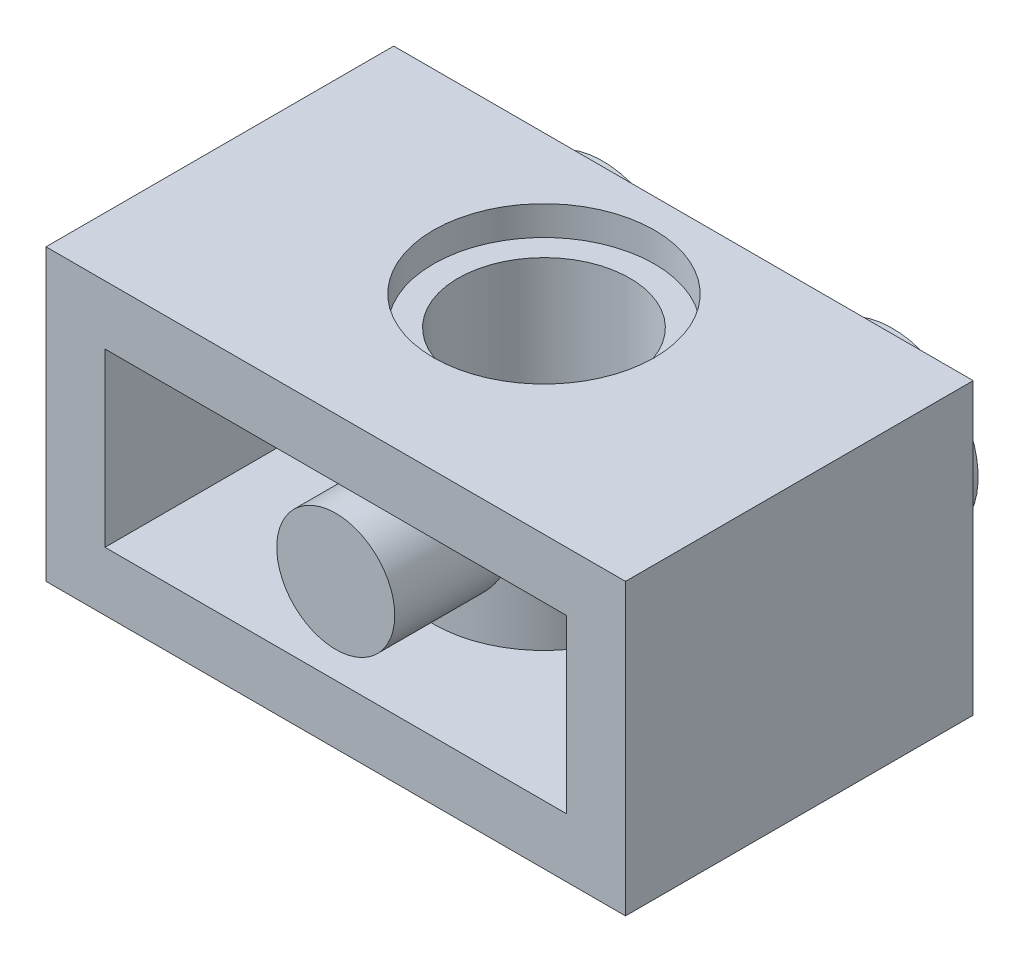
ISO-10303-21;
HEADER;
FILE_DESCRIPTION(('STEP AP214'),'2;1');
FILE_NAME('part.step','',(''),(''),'','','');
FILE_SCHEMA(('AUTOMOTIVE_DESIGN { 1 0 10303 214 1 1 1 1 }'));
ENDSEC;
DATA;
#1=APPLICATION_CONTEXT('core data for automotive mechanical design processes');
#2=APPLICATION_PROTOCOL_DEFINITION('international standard','automotive_design',2000,#1);
#3=PRODUCT_CONTEXT('',#1,'mechanical');
#4=PRODUCT('Part','Part','',(#3));
#5=PRODUCT_RELATED_PRODUCT_CATEGORY('part','',(#4));
#6=PRODUCT_DEFINITION_FORMATION('','',#4);
#7=PRODUCT_DEFINITION_CONTEXT('part definition',#1,'design');
#8=PRODUCT_DEFINITION('design','',#6,#7);
#9=PRODUCT_DEFINITION_SHAPE('','',#8);
#10=(LENGTH_UNIT() NAMED_UNIT(*) SI_UNIT(.MILLI.,.METRE.));
#11=(NAMED_UNIT(*) PLANE_ANGLE_UNIT() SI_UNIT($,.RADIAN.));
#12=(NAMED_UNIT(*) SI_UNIT($,.STERADIAN.) SOLID_ANGLE_UNIT());
#13=UNCERTAINTY_MEASURE_WITH_UNIT(LENGTH_MEASURE(1.E-05),#10,'distance_accuracy_value','');
#14=(GEOMETRIC_REPRESENTATION_CONTEXT(3) GLOBAL_UNCERTAINTY_ASSIGNED_CONTEXT((#13)) GLOBAL_UNIT_ASSIGNED_CONTEXT((#10,
#11,#12)) REPRESENTATION_CONTEXT('',''));
#15=CARTESIAN_POINT('',(0.,0.,0.));
#16=DIRECTION('',(0.,0.,1.));
#17=DIRECTION('',(1.,0.,0.));
#18=AXIS2_PLACEMENT_3D('',#15,#16,#17);
#19=CARTESIAN_POINT('',(0.,-4.0325,4.839));
#20=DIRECTION('',(0.,0.,1.));
#21=DIRECTION('',(1.,0.,0.));
#22=AXIS2_PLACEMENT_3D('',#19,#20,#21);
#23=PLANE('',#22);
#24=CARTESIAN_POINT('',(0.,0.,4.839));
#25=DIRECTION('',(0.,0.,1.));
#26=DIRECTION('',(1.,0.,0.));
#27=AXIS2_PLACEMENT_3D('',#24,#25,#26);
#28=CIRCLE('',#27,1.6425);
#29=CARTESIAN_POINT('',(1.6425,0.,4.839));
#30=VERTEX_POINT('',#29);
#31=EDGE_CURVE('E19',#30,#30,#28,.F.);
#32=ORIENTED_EDGE('',*,*,#31,.F.);
#33=EDGE_LOOP('',(#32));
#34=FACE_BOUND('',#33,.T.);
#35=ADVANCED_FACE('F16',(#34),#23,.T.);
#36=CARTESIAN_POINT('',(8.065,-4.0325,-4.839));
#37=DIRECTION('',(0.,0.,-1.));
#38=DIRECTION('',(-1.,0.,0.));
#39=AXIS2_PLACEMENT_3D('',#36,#37,#38);
#40=PLANE('',#39);
#41=CARTESIAN_POINT('',(-4.0325,0.,-4.839));
#42=DIRECTION('',(0.,0.,-1.));
#43=DIRECTION('',(-1.,0.,0.));
#44=AXIS2_PLACEMENT_3D('',#41,#42,#43);
#45=CIRCLE('',#44,1.6425);
#46=CARTESIAN_POINT('',(-5.675,0.,-4.839));
#47=VERTEX_POINT('',#46);
#48=EDGE_CURVE('E368',#47,#47,#45,.T.);
#49=ORIENTED_EDGE('',*,*,#48,.T.);
#50=EDGE_LOOP('',(#49));
#51=FACE_BOUND('',#50,.T.);
#52=ADVANCED_FACE('F379',(#51),#40,.T.);
#53=CARTESIAN_POINT('',(8.065,-4.0325,-4.839));
#54=DIRECTION('',(0.,0.,-1.));
#55=DIRECTION('',(-1.,0.,0.));
#56=AXIS2_PLACEMENT_3D('',#53,#54,#55);
#57=PLANE('',#56);
#58=CARTESIAN_POINT('',(4.0325,0.,-4.839));
#59=DIRECTION('',(0.,0.,-1.));
#60=DIRECTION('',(-1.,0.,0.));
#61=AXIS2_PLACEMENT_3D('',#58,#59,#60);
#62=CIRCLE('',#61,1.6425);
#63=CARTESIAN_POINT('',(2.39,0.,-4.839));
#64=VERTEX_POINT('',#63);
#65=EDGE_CURVE('E142',#64,#64,#62,.T.);
#66=ORIENTED_EDGE('',*,*,#65,.T.);
#67=EDGE_LOOP('',(#66));
#68=FACE_BOUND('',#67,.T.);
#69=ADVANCED_FACE('F174',(#68),#57,.T.);
#70=CARTESIAN_POINT('',(0.,0.,4.839));
#71=DIRECTION('',(0.,0.,1.));
#72=DIRECTION('',(1.,0.,0.));
#73=AXIS2_PLACEMENT_3D('',#70,#71,#72);
#74=CYLINDRICAL_SURFACE('',#73,1.6425);
#75=ORIENTED_EDGE('',*,*,#31,.T.);
#76=EDGE_LOOP('',(#75));
#77=FACE_BOUND('',#76,.T.);
#78=CARTESIAN_POINT('',(-1.64249999485551,-3.70608180880229E-08,1.64358049216812));
#79=CARTESIAN_POINT('',(-1.64249559488355,0.0846956475252511,1.64358653790426));
#80=CARTESIAN_POINT('',(-1.6359087181486,0.169429857933965,1.64778101822955));
#81=CARTESIAN_POINT('',(-1.60994606027142,0.336190357602549,1.66390797739999));
#82=CARTESIAN_POINT('',(-1.59055517110292,0.418213327546044,1.67584959714927));
#83=CARTESIAN_POINT('',(-1.54010835824431,0.576860048086994,1.7056790936548));
#84=CARTESIAN_POINT('',(-1.50911852183764,0.653511520501801,1.72353321757458));
#85=CARTESIAN_POINT('',(-1.43656232796772,0.800513698090321,1.76312072073227));
#86=CARTESIAN_POINT('',(-1.39499295203209,0.870862597304915,1.78485520655587));
#87=CARTESIAN_POINT('',(-1.29784534916877,1.01060123957711,1.83226270823662));
#88=CARTESIAN_POINT('',(-1.24131233018339,1.07926703560096,1.85811375790081));
#89=CARTESIAN_POINT('',(-1.1178193417297,1.20671694485721,1.90941067305075));
#90=CARTESIAN_POINT('',(-1.05085372779594,1.26549567276215,1.93485631092861));
#91=CARTESIAN_POINT('',(-0.901893193080416,1.37610494028443,1.98489421523878));
#92=CARTESIAN_POINT('',(-0.819126036246932,1.42700919532592,2.00925709184428));
#93=CARTESIAN_POINT('',(-0.644655617859076,1.51383563168207,2.05200360082336));
#94=CARTESIAN_POINT('',(-0.552958843313448,1.54976859034089,2.07039153225742));
#95=CARTESIAN_POINT('',(-0.370934827626963,1.60264427144133,2.09782047739748));
#96=CARTESIAN_POINT('',(-0.281076067235135,1.62086740993668,2.10748728919025));
#97=CARTESIAN_POINT('',(-0.0991002933566199,1.64205933699828,2.1187507287066));
#98=CARTESIAN_POINT('',(-0.00698491182808272,1.64503884034871,2.12035302498276));
#99=CARTESIAN_POINT('',(0.167108617996855,1.63606845448583,2.11556844546189));
#100=CARTESIAN_POINT('',(0.249188218699515,1.62556615202254,2.10995614033198));
#101=CARTESIAN_POINT('',(0.410213154137852,1.59257225857043,2.09259125338547));
#102=CARTESIAN_POINT('',(0.489158265170417,1.57007981351251,2.08083823416124));
#103=CARTESIAN_POINT('',(0.642909969351374,1.51369183544886,2.05207057777214));
#104=CARTESIAN_POINT('',(0.717655865444991,1.47966330485719,2.03499476891686));
#105=CARTESIAN_POINT('',(0.860534710738926,1.40140238504881,1.9970623061314));
#106=CARTESIAN_POINT('',(0.928665497240362,1.35716667461911,1.97620442206344));
#107=CARTESIAN_POINT('',(1.06393306770279,1.25450831465863,1.93005135316963));
#108=CARTESIAN_POINT('',(1.13023403989571,1.19509015135897,1.90452031891285));
#109=CARTESIAN_POINT('',(1.25242227087692,1.06636378833612,1.85317534520696));
#110=CARTESIAN_POINT('',(1.30829806027793,0.997044842399312,1.82736112687123));
#111=CARTESIAN_POINT('',(1.41247891680776,0.843783437917859,1.77606201444236));
#112=CARTESIAN_POINT('',(1.4598184152903,0.759114247875707,1.75076930029746));
#113=CARTESIAN_POINT('',(1.53919934555228,0.581451919872124,1.70643849654131));
#114=CARTESIAN_POINT('',(1.57127381353549,0.488477279464372,1.68738692812425));
#115=CARTESIAN_POINT('',(1.61056026257685,0.328976224491044,1.66355174845996));
#116=CARTESIAN_POINT('',(1.62249761589875,0.263981779092716,1.65612822510832));
#117=CARTESIAN_POINT('',(1.63846783889228,0.132665803586769,1.64614107191913));
#118=CARTESIAN_POINT('',(1.64250344608909,0.0663447411269074,1.64357575898606));
#119=CARTESIAN_POINT('',(1.6424956007207,-0.0846956456049919,1.6435865410049));
#120=CARTESIAN_POINT('',(1.63590871989194,-0.16942985601023,1.64778101894795));
#121=CARTESIAN_POINT('',(1.60994605907705,-0.336190355990545,1.66390797633834));
#122=CARTESIAN_POINT('',(1.59055517104549,-0.418213326243841,1.67584959670871));
#123=CARTESIAN_POINT('',(1.540108359019,-0.576860047125375,1.70567909366854));
#124=CARTESIAN_POINT('',(1.50911852234774,-0.653511519584645,1.72353321740947));
#125=CARTESIAN_POINT('',(1.43656232836588,-0.800513697167399,1.76312072040175));
#126=CARTESIAN_POINT('',(1.39499295259801,-0.870862596340753,1.78485520623334));
#127=CARTESIAN_POINT('',(1.29784534998339,-1.0106012385697,1.83226270788982));
#128=CARTESIAN_POINT('',(1.2413123310669,-1.07926703459025,1.85811375751778));
#129=CARTESIAN_POINT('',(1.11781934274469,-1.20671694390867,1.90941067264519));
#130=CARTESIAN_POINT('',(1.05085372886577,-1.26549567187167,1.93485631053644));
#131=CARTESIAN_POINT('',(0.901893194238855,-1.3761049395279,1.984894214885));
#132=CARTESIAN_POINT('',(0.819126037436544,-1.42700919464419,2.00925709151568));
#133=CARTESIAN_POINT('',(0.644655619126311,-1.51383563114091,2.05200360054988));
#134=CARTESIAN_POINT('',(0.552958844629835,-1.54976858986998,2.07039153201566));
#135=CARTESIAN_POINT('',(0.370934828987265,-1.60264427112767,2.09782047723246));
#136=CARTESIAN_POINT('',(0.281076068589214,-1.62086740970322,2.10748728906656));
#137=CARTESIAN_POINT('',(0.0991002946753006,-1.64205933692033,2.11875072866475));
#138=CARTESIAN_POINT('',(0.00698491311744856,-1.64503884034507,2.12035302498087));
#139=CARTESIAN_POINT('',(-0.167108616755531,-1.63606845461304,2.11556844552972));
#140=CARTESIAN_POINT('',(-0.249188217475787,-1.62556615221068,2.10995614043198));
#141=CARTESIAN_POINT('',(-0.410213152966037,-1.59257225887315,2.0925912535438));
#142=CARTESIAN_POINT('',(-0.489158264032656,-1.57007981386787,2.08083823434521));
#143=CARTESIAN_POINT('',(-0.642909968274843,-1.51369183590638,2.05207057800285));
#144=CARTESIAN_POINT('',(-0.717655864396655,-1.47966330536616,2.03499476916952));
#145=CARTESIAN_POINT('',(-0.860534709727674,-1.40140238566804,1.99706230642558));
#146=CARTESIAN_POINT('',(-0.928665496240138,-1.35716667530042,1.97620442237838));
#147=CARTESIAN_POINT('',(-1.06393306671879,-1.25450831549128,1.93005135353442));
#148=CARTESIAN_POINT('',(-1.13023403892227,-1.19509015228503,1.90452031930737));
#149=CARTESIAN_POINT('',(-1.25242226996065,-1.06636378940105,1.85317534560657));
#150=CARTESIAN_POINT('',(-1.30829805939937,-0.997044843501366,1.82736112724594));
#151=CARTESIAN_POINT('',(-1.41247891618253,-0.84378343904331,1.77606201481276));
#152=CARTESIAN_POINT('',(-1.45981841488401,-0.759114248980839,1.75076930069515));
#153=CARTESIAN_POINT('',(-1.5391993449418,-0.581451921042507,1.70643849671193));
#154=CARTESIAN_POINT('',(-1.57127381252696,-0.488477280733728,1.68738692803148));
#155=CARTESIAN_POINT('',(-1.61056026280251,-0.328976225457433,1.66355174879242));
#156=CARTESIAN_POINT('',(-1.62249761710513,-0.263981779626139,1.65612822584909));
#157=CARTESIAN_POINT('',(-1.63846783769064,-0.132665803017987,1.64614107117591));
#158=CARTESIAN_POINT('',(-1.64250344148722,-0.0663447398867075,1.64357575635933));
#159=CARTESIAN_POINT('',(-1.64249999485551,-3.70608180880229E-08,1.64358049216812));
#160=B_SPLINE_CURVE_WITH_KNOTS('',3,(#78,#79,#80,#81,#82,#83,#84,#85,#86,#87,#88,#89,#90,#91,
#92,#93,#94,#95,#96,#97,#98,#99,#100,#101,#102,#103,#104,#105,#106,#107,#108,#109,#110,#111,
#112,#113,#114,#115,#116,#117,#118,#119,#120,#121,#122,#123,#124,#125,#126,#127,#128,#129,#130,
#131,#132,#133,#134,#135,#136,#137,#138,#139,#140,#141,#142,#143,#144,#145,#146,#147,#148,#149,
#150,#151,#152,#153,#154,#155,#156,#157,#158,#159),.UNSPECIFIED.,.T.,.F.,(4,2,2,2,2,2,2,2,2,2,2,
2,2,2,2,2,2,2,2,2,2,2,2,2,2,2,2,2,2,2,2,2,2,2,2,2,2,2,2,2,4),(0.,0.253813209368293,
0.507926440732396,0.760613323412868,1.0133723817406,1.29010697288646,1.56699181222784,
1.86592988276616,2.1646523842443,2.43967597833787,2.71450623116586,2.96215169029204,
3.20981479179403,3.46043616044831,3.71113919158318,3.9878413925589,4.26484623848291,
4.56405013875503,4.86260353116237,5.06149204352721,5.26031163964159,5.5141248492923,
5.76823808144374,6.02092496421917,6.27368402228288,6.55041861323503,6.82730345258999,
7.12624152317947,7.42496402461913,7.69998761879037,7.97481787171393,8.222463330862,
8.47012643240668,8.72074780105869,8.97145083211056,9.24815303289414,9.52515787886038,
9.82436177935767,10.1229151715204,10.3218036852912,10.5206232831387),.UNSPECIFIED.);
#161=CARTESIAN_POINT('',(-1.64249999485551,-3.70608180880229E-08,1.64358049216812));
#162=VERTEX_POINT('',#161);
#163=EDGE_CURVE('E104',#162,#162,#160,.T.);
#164=ORIENTED_EDGE('',*,*,#163,.F.);
#165=EDGE_LOOP('',(#164));
#166=FACE_BOUND('',#165,.T.);
#167=ADVANCED_FACE('F143',(#77,#166),#74,.T.);
#168=CARTESIAN_POINT('',(-4.0325,0.,-4.839));
#169=DIRECTION('',(0.,0.,-1.));
#170=DIRECTION('',(-1.,0.,0.));
#171=AXIS2_PLACEMENT_3D('',#168,#169,#170);
#172=CYLINDRICAL_SURFACE('',#171,1.6425);
#173=CARTESIAN_POINT('',(-4.0325,0.,-6.619));
#174=DIRECTION('',(0.,0.,-1.));
#175=DIRECTION('',(-1.,0.,0.));
#176=AXIS2_PLACEMENT_3D('',#173,#174,#175);
#177=CIRCLE('',#176,1.6425);
#178=CARTESIAN_POINT('',(-5.675,0.,-6.619));
#179=VERTEX_POINT('',#178);
#180=EDGE_CURVE('E130',#179,#179,#177,.F.);
#181=ORIENTED_EDGE('',*,*,#180,.F.);
#182=EDGE_LOOP('',(#181));
#183=FACE_BOUND('',#182,.T.);
#184=ORIENTED_EDGE('',*,*,#48,.F.);
#185=EDGE_LOOP('',(#184));
#186=FACE_BOUND('',#185,.T.);
#187=ADVANCED_FACE('F166',(#183,#186),#172,.F.);
#188=CARTESIAN_POINT('',(4.0325,0.,-4.839));
#189=DIRECTION('',(0.,0.,-1.));
#190=DIRECTION('',(-1.,0.,0.));
#191=AXIS2_PLACEMENT_3D('',#188,#189,#190);
#192=CYLINDRICAL_SURFACE('',#191,1.6425);
#193=CARTESIAN_POINT('',(4.0325,0.,-6.619));
#194=DIRECTION('',(0.,0.,-1.));
#195=DIRECTION('',(-1.,0.,0.));
#196=AXIS2_PLACEMENT_3D('',#193,#194,#195);
#197=CIRCLE('',#196,1.6425);
#198=CARTESIAN_POINT('',(2.39,0.,-6.619));
#199=VERTEX_POINT('',#198);
#200=EDGE_CURVE('E127',#199,#199,#197,.F.);
#201=ORIENTED_EDGE('',*,*,#200,.F.);
#202=EDGE_LOOP('',(#201));
#203=FACE_BOUND('',#202,.T.);
#204=ORIENTED_EDGE('',*,*,#65,.F.);
#205=EDGE_LOOP('',(#204));
#206=FACE_BOUND('',#205,.T.);
#207=ADVANCED_FACE('F163',(#203,#206),#192,.F.);
#208=CARTESIAN_POINT('',(0.,3.2175,0.));
#209=DIRECTION('',(0.,1.,0.));
#210=DIRECTION('',(0.,0.,1.));
#211=AXIS2_PLACEMENT_3D('',#208,#209,#210);
#212=PLANE('',#211);
#213=CARTESIAN_POINT('',(0.,3.2175,-0.956));
#214=DIRECTION('',(0.,1.,0.));
#215=DIRECTION('',(0.,0.,1.));
#216=AXIS2_PLACEMENT_3D('',#213,#214,#215);
#217=CIRCLE('',#216,2.39);
#218=CARTESIAN_POINT('',(0.,3.2175,1.434));
#219=VERTEX_POINT('',#218);
#220=EDGE_CURVE('E119',#219,#219,#217,.F.);
#221=ORIENTED_EDGE('',*,*,#220,.T.);
#222=EDGE_LOOP('',(#221));
#223=FACE_BOUND('',#222,.T.);
#224=CARTESIAN_POINT('',(0.,3.2175,-0.956));
#225=DIRECTION('',(0.,1.,0.));
#226=DIRECTION('',(0.,0.,1.));
#227=AXIS2_PLACEMENT_3D('',#224,#225,#226);
#228=CIRCLE('',#227,3.075);
#229=CARTESIAN_POINT('',(0.,3.2175,2.119));
#230=VERTEX_POINT('',#229);
#231=EDGE_CURVE('E133',#230,#230,#228,.T.);
#232=ORIENTED_EDGE('',*,*,#231,.T.);
#233=EDGE_LOOP('',(#232));
#234=FACE_BOUND('',#233,.T.);
#235=ADVANCED_FACE('F160',(#223,#234),#212,.T.);
#236=CARTESIAN_POINT('',(8.065,-4.0325,-3.1965));
#237=DIRECTION('',(0.,0.,-1.));
#238=DIRECTION('',(-1.,0.,0.));
#239=AXIS2_PLACEMENT_3D('',#236,#237,#238);
#240=PLANE('',#239);
#241=DIRECTION('',(0.,1.,0.));
#242=VECTOR('',#241,1.);
#243=CARTESIAN_POINT('',(-6.4225,-4.0325,-3.1965));
#244=LINE('',#243,#242);
#245=CARTESIAN_POINT('',(-6.4225,2.39,-3.1965));
#246=VERTEX_POINT('',#245);
#247=CARTESIAN_POINT('',(-6.4225,-2.39,-3.1965));
#248=VERTEX_POINT('',#247);
#249=EDGE_CURVE('E117',#246,#248,#244,.F.);
#250=ORIENTED_EDGE('',*,*,#249,.T.);
#251=DIRECTION('',(1.,0.,0.));
#252=VECTOR('',#251,1.);
#253=CARTESIAN_POINT('',(0.,-2.39,-3.1965));
#254=LINE('',#253,#252);
#255=CARTESIAN_POINT('',(-2.10613027849656,-2.39,-3.1965));
#256=VERTEX_POINT('',#255);
#257=EDGE_CURVE('E102',#256,#248,#254,.F.);
#258=ORIENTED_EDGE('',*,*,#257,.F.);
#259=DIRECTION('',(0.,1.,0.));
#260=VECTOR('',#259,1.);
#261=CARTESIAN_POINT('',(-2.10613027849656,4.0325,-3.1965));
#262=LINE('',#261,#260);
#263=CARTESIAN_POINT('',(-2.10613027849656,2.39,-3.1965));
#264=VERTEX_POINT('',#263);
#265=EDGE_CURVE('E97',#264,#256,#262,.F.);
#266=ORIENTED_EDGE('',*,*,#265,.F.);
#267=DIRECTION('',(1.,0.,0.));
#268=VECTOR('',#267,1.);
#269=CARTESIAN_POINT('',(0.,2.39,-3.1965));
#270=LINE('',#269,#268);
#271=EDGE_CURVE('E101',#264,#246,#270,.F.);
#272=ORIENTED_EDGE('',*,*,#271,.T.);
#273=EDGE_LOOP('',(#250,#258,#266,#272));
#274=FACE_BOUND('',#273,.T.);
#275=ADVANCED_FACE('F100',(#274),#240,.F.);
#276=CARTESIAN_POINT('',(8.065,-4.0325,-3.1965));
#277=DIRECTION('',(0.,0.,-1.));
#278=DIRECTION('',(-1.,0.,0.));
#279=AXIS2_PLACEMENT_3D('',#276,#277,#278);
#280=PLANE('',#279);
#281=DIRECTION('',(0.,1.,0.));
#282=VECTOR('',#281,1.);
#283=CARTESIAN_POINT('',(6.4225,-4.0325,-3.1965));
#284=LINE('',#283,#282);
#285=CARTESIAN_POINT('',(6.4225,-2.39,-3.1965));
#286=VERTEX_POINT('',#285);
#287=CARTESIAN_POINT('',(6.4225,2.39,-3.1965));
#288=VERTEX_POINT('',#287);
#289=EDGE_CURVE('E284',#286,#288,#284,.T.);
#290=ORIENTED_EDGE('',*,*,#289,.T.);
#291=DIRECTION('',(1.,0.,0.));
#292=VECTOR('',#291,1.);
#293=CARTESIAN_POINT('',(0.,2.39,-3.1965));
#294=LINE('',#293,#292);
#295=CARTESIAN_POINT('',(2.10613027849656,2.39,-3.1965));
#296=VERTEX_POINT('',#295);
#297=EDGE_CURVE('E279',#288,#296,#294,.F.);
#298=ORIENTED_EDGE('',*,*,#297,.T.);
#299=DIRECTION('',(0.,1.,0.));
#300=VECTOR('',#299,1.);
#301=CARTESIAN_POINT('',(2.10613027849656,4.0325,-3.1965));
#302=LINE('',#301,#300);
#303=CARTESIAN_POINT('',(2.10613027849656,-2.39,-3.1965));
#304=VERTEX_POINT('',#303);
#305=EDGE_CURVE('E91',#304,#296,#302,.T.);
#306=ORIENTED_EDGE('',*,*,#305,.F.);
#307=DIRECTION('',(1.,0.,0.));
#308=VECTOR('',#307,1.);
#309=CARTESIAN_POINT('',(0.,-2.39,-3.1965));
#310=LINE('',#309,#308);
#311=EDGE_CURVE('E311',#286,#304,#310,.F.);
#312=ORIENTED_EDGE('',*,*,#311,.F.);
#313=EDGE_LOOP('',(#290,#298,#306,#312));
#314=FACE_BOUND('',#313,.T.);
#315=ADVANCED_FACE('F152',(#314),#280,.F.);
#316=CARTESIAN_POINT('',(0.,4.0325,-0.956));
#317=DIRECTION('',(0.,1.,0.));
#318=DIRECTION('',(0.,0.,1.));
#319=AXIS2_PLACEMENT_3D('',#316,#317,#318);
#320=CYLINDRICAL_SURFACE('',#319,3.075);
#321=ORIENTED_EDGE('',*,*,#163,.T.);
#322=EDGE_LOOP('',(#321));
#323=FACE_BOUND('',#322,.T.);
#324=ORIENTED_EDGE('',*,*,#265,.T.);
#325=CARTESIAN_POINT('',(0.,-2.39,-0.956));
#326=DIRECTION('',(0.,1.,0.));
#327=DIRECTION('',(0.,0.,1.));
#328=AXIS2_PLACEMENT_3D('',#325,#326,#327);
#329=CIRCLE('',#328,3.075);
#330=EDGE_CURVE('E123',#304,#256,#329,.F.);
#331=ORIENTED_EDGE('',*,*,#330,.F.);
#332=ORIENTED_EDGE('',*,*,#305,.T.);
#333=CARTESIAN_POINT('',(0.,2.39,-0.956));
#334=DIRECTION('',(0.,1.,0.));
#335=DIRECTION('',(0.,0.,1.));
#336=AXIS2_PLACEMENT_3D('',#333,#334,#335);
#337=CIRCLE('',#336,3.075);
#338=EDGE_CURVE('E110',#296,#264,#337,.F.);
#339=ORIENTED_EDGE('',*,*,#338,.T.);
#340=EDGE_LOOP('',(#324,#331,#332,#339));
#341=FACE_BOUND('',#340,.T.);
#342=ADVANCED_FACE('F116',(#323,#341),#320,.T.);
#343=CARTESIAN_POINT('',(0.,4.0325,-0.956));
#344=DIRECTION('',(0.,1.,0.));
#345=DIRECTION('',(0.,0.,1.));
#346=AXIS2_PLACEMENT_3D('',#343,#344,#345);
#347=CYLINDRICAL_SURFACE('',#346,3.075);
#348=ORIENTED_EDGE('',*,*,#231,.F.);
#349=EDGE_LOOP('',(#348));
#350=FACE_BOUND('',#349,.T.);
#351=CARTESIAN_POINT('',(0.,4.0325,-0.956));
#352=DIRECTION('',(0.,1.,0.));
#353=DIRECTION('',(0.,0.,1.));
#354=AXIS2_PLACEMENT_3D('',#351,#352,#353);
#355=CIRCLE('',#354,3.075);
#356=CARTESIAN_POINT('',(0.,4.0325,2.119));
#357=VERTEX_POINT('',#356);
#358=EDGE_CURVE('E256',#357,#357,#355,.F.);
#359=ORIENTED_EDGE('',*,*,#358,.F.);
#360=EDGE_LOOP('',(#359));
#361=FACE_BOUND('',#360,.T.);
#362=ADVANCED_FACE('F151',(#350,#361),#347,.F.);
#363=CARTESIAN_POINT('',(0.,-4.0325,-6.619));
#364=DIRECTION('',(0.,0.,-1.));
#365=DIRECTION('',(-1.,0.,0.));
#366=AXIS2_PLACEMENT_3D('',#363,#364,#365);
#367=PLANE('',#366);
#368=ORIENTED_EDGE('',*,*,#180,.T.);
#369=EDGE_LOOP('',(#368));
#370=FACE_BOUND('',#369,.T.);
#371=CARTESIAN_POINT('',(-4.0325,0.,-6.619));
#372=DIRECTION('',(0.,0.,-1.));
#373=DIRECTION('',(-1.,0.,0.));
#374=AXIS2_PLACEMENT_3D('',#371,#372,#373);
#375=CIRCLE('',#374,2.39);
#376=CARTESIAN_POINT('',(-6.4225,0.,-6.619));
#377=VERTEX_POINT('',#376);
#378=EDGE_CURVE('E254',#377,#377,#375,.F.);
#379=ORIENTED_EDGE('',*,*,#378,.F.);
#380=EDGE_LOOP('',(#379));
#381=FACE_BOUND('',#380,.T.);
#382=ADVANCED_FACE('F243',(#370,#381),#367,.T.);
#383=CARTESIAN_POINT('',(0.,-4.0325,-6.619));
#384=DIRECTION('',(0.,0.,-1.));
#385=DIRECTION('',(-1.,0.,0.));
#386=AXIS2_PLACEMENT_3D('',#383,#384,#385);
#387=PLANE('',#386);
#388=ORIENTED_EDGE('',*,*,#200,.T.);
#389=EDGE_LOOP('',(#388));
#390=FACE_BOUND('',#389,.T.);
#391=CARTESIAN_POINT('',(4.0325,0.,-6.619));
#392=DIRECTION('',(0.,0.,-1.));
#393=DIRECTION('',(-1.,0.,0.));
#394=AXIS2_PLACEMENT_3D('',#391,#392,#393);
#395=CIRCLE('',#394,2.39);
#396=CARTESIAN_POINT('',(1.6425,0.,-6.619));
#397=VERTEX_POINT('',#396);
#398=EDGE_CURVE('E255',#397,#397,#395,.F.);
#399=ORIENTED_EDGE('',*,*,#398,.F.);
#400=EDGE_LOOP('',(#399));
#401=FACE_BOUND('',#400,.T.);
#402=ADVANCED_FACE('F240',(#390,#401),#387,.T.);
#403=CARTESIAN_POINT('',(0.,4.0325,-0.956));
#404=DIRECTION('',(0.,1.,0.));
#405=DIRECTION('',(0.,0.,1.));
#406=AXIS2_PLACEMENT_3D('',#403,#404,#405);
#407=CYLINDRICAL_SURFACE('',#406,2.39);
#408=ORIENTED_EDGE('',*,*,#220,.F.);
#409=EDGE_LOOP('',(#408));
#410=FACE_BOUND('',#409,.T.);
#411=CARTESIAN_POINT('',(0.,-3.2175,-0.956));
#412=DIRECTION('',(0.,1.,0.));
#413=DIRECTION('',(0.,0.,1.));
#414=AXIS2_PLACEMENT_3D('',#411,#412,#413);
#415=CIRCLE('',#414,2.39);
#416=CARTESIAN_POINT('',(0.,-3.2175,1.434));
#417=VERTEX_POINT('',#416);
#418=EDGE_CURVE('E259',#417,#417,#415,.F.);
#419=ORIENTED_EDGE('',*,*,#418,.T.);
#420=EDGE_LOOP('',(#419));
#421=FACE_BOUND('',#420,.T.);
#422=ADVANCED_FACE('F236',(#410,#421),#407,.F.);
#423=CARTESIAN_POINT('',(-6.4225,-4.0325,-4.839));
#424=DIRECTION('',(-1.,0.,0.));
#425=DIRECTION('',(0.,0.,1.));
#426=AXIS2_PLACEMENT_3D('',#423,#424,#425);
#427=PLANE('',#426);
#428=ORIENTED_EDGE('',*,*,#249,.F.);
#429=DIRECTION('',(0.,0.,1.));
#430=VECTOR('',#429,1.);
#431=CARTESIAN_POINT('',(-6.4225,2.39,0.));
#432=LINE('',#431,#430);
#433=CARTESIAN_POINT('',(-6.4225,2.39,4.839));
#434=VERTEX_POINT('',#433);
#435=EDGE_CURVE('E114',#246,#434,#432,.T.);
#436=ORIENTED_EDGE('',*,*,#435,.T.);
#437=DIRECTION('',(0.,1.,0.));
#438=VECTOR('',#437,1.);
#439=CARTESIAN_POINT('',(-6.4225,-4.0325,4.839));
#440=LINE('',#439,#438);
#441=CARTESIAN_POINT('',(-6.4225,-2.39,4.839));
#442=VERTEX_POINT('',#441);
#443=EDGE_CURVE('E329',#442,#434,#440,.T.);
#444=ORIENTED_EDGE('',*,*,#443,.F.);
#445=DIRECTION('',(0.,0.,1.));
#446=VECTOR('',#445,1.);
#447=CARTESIAN_POINT('',(-6.4225,-2.39,0.));
#448=LINE('',#447,#446);
#449=EDGE_CURVE('E287',#248,#442,#448,.T.);
#450=ORIENTED_EDGE('',*,*,#449,.F.);
#451=EDGE_LOOP('',(#428,#436,#444,#450));
#452=FACE_BOUND('',#451,.T.);
#453=ADVANCED_FACE('F233',(#452),#427,.F.);
#454=CARTESIAN_POINT('',(0.,2.39,0.));
#455=DIRECTION('',(0.,1.,0.));
#456=DIRECTION('',(0.,0.,1.));
#457=AXIS2_PLACEMENT_3D('',#454,#455,#456);
#458=PLANE('',#457);
#459=DIRECTION('',(0.,0.,-1.));
#460=VECTOR('',#459,1.);
#461=CARTESIAN_POINT('',(6.4225,2.39,4.839));
#462=LINE('',#461,#460);
#463=CARTESIAN_POINT('',(6.4225,2.39,4.839));
#464=VERTEX_POINT('',#463);
#465=EDGE_CURVE('E282',#288,#464,#462,.F.);
#466=ORIENTED_EDGE('',*,*,#465,.T.);
#467=DIRECTION('',(1.,0.,0.));
#468=VECTOR('',#467,1.);
#469=CARTESIAN_POINT('',(-8.065,2.39,4.839));
#470=LINE('',#469,#468);
#471=EDGE_CURVE('E302',#434,#464,#470,.T.);
#472=ORIENTED_EDGE('',*,*,#471,.F.);
#473=ORIENTED_EDGE('',*,*,#435,.F.);
#474=ORIENTED_EDGE('',*,*,#271,.F.);
#475=ORIENTED_EDGE('',*,*,#338,.F.);
#476=ORIENTED_EDGE('',*,*,#297,.F.);
#477=EDGE_LOOP('',(#466,#472,#473,#474,#475,#476));
#478=FACE_BOUND('',#477,.T.);
#479=ADVANCED_FACE('F109',(#478),#458,.F.);
#480=CARTESIAN_POINT('',(6.4225,-4.0325,4.839));
#481=DIRECTION('',(1.,0.,0.));
#482=DIRECTION('',(0.,0.,-1.));
#483=AXIS2_PLACEMENT_3D('',#480,#481,#482);
#484=PLANE('',#483);
#485=ORIENTED_EDGE('',*,*,#289,.F.);
#486=DIRECTION('',(0.,0.,1.));
#487=VECTOR('',#486,1.);
#488=CARTESIAN_POINT('',(6.4225,-2.39,0.));
#489=LINE('',#488,#487);
#490=CARTESIAN_POINT('',(6.4225,-2.39,4.839));
#491=VERTEX_POINT('',#490);
#492=EDGE_CURVE('E289',#491,#286,#489,.F.);
#493=ORIENTED_EDGE('',*,*,#492,.F.);
#494=DIRECTION('',(0.,1.,0.));
#495=VECTOR('',#494,1.);
#496=CARTESIAN_POINT('',(6.4225,-4.0325,4.839));
#497=LINE('',#496,#495);
#498=EDGE_CURVE('E298',#464,#491,#497,.F.);
#499=ORIENTED_EDGE('',*,*,#498,.F.);
#500=ORIENTED_EDGE('',*,*,#465,.F.);
#501=EDGE_LOOP('',(#485,#493,#499,#500));
#502=FACE_BOUND('',#501,.T.);
#503=ADVANCED_FACE('F226',(#502),#484,.F.);
#504=CARTESIAN_POINT('',(0.,-2.39,0.));
#505=DIRECTION('',(0.,1.,0.));
#506=DIRECTION('',(0.,0.,1.));
#507=AXIS2_PLACEMENT_3D('',#504,#505,#506);
#508=PLANE('',#507);
#509=ORIENTED_EDGE('',*,*,#311,.T.);
#510=ORIENTED_EDGE('',*,*,#330,.T.);
#511=ORIENTED_EDGE('',*,*,#257,.T.);
#512=ORIENTED_EDGE('',*,*,#449,.T.);
#513=DIRECTION('',(1.,0.,0.));
#514=VECTOR('',#513,1.);
#515=CARTESIAN_POINT('',(-8.065,-2.39,4.839));
#516=LINE('',#515,#514);
#517=EDGE_CURVE('E294',#491,#442,#516,.F.);
#518=ORIENTED_EDGE('',*,*,#517,.F.);
#519=ORIENTED_EDGE('',*,*,#492,.T.);
#520=EDGE_LOOP('',(#509,#510,#511,#512,#518,#519));
#521=FACE_BOUND('',#520,.T.);
#522=ADVANCED_FACE('F222',(#521),#508,.T.);
#523=CARTESIAN_POINT('',(0.,4.0325,0.));
#524=DIRECTION('',(0.,1.,0.));
#525=DIRECTION('',(0.,0.,1.));
#526=AXIS2_PLACEMENT_3D('',#523,#524,#525);
#527=PLANE('',#526);
#528=ORIENTED_EDGE('',*,*,#358,.T.);
#529=EDGE_LOOP('',(#528));
#530=FACE_BOUND('',#529,.T.);
#531=DIRECTION('',(-1.,0.,0.));
#532=VECTOR('',#531,1.);
#533=CARTESIAN_POINT('',(8.065,4.0325,-4.839));
#534=LINE('',#533,#532);
#535=CARTESIAN_POINT('',(-8.065,4.0325,-4.839));
#536=VERTEX_POINT('',#535);
#537=CARTESIAN_POINT('',(8.065,4.0325,-4.839));
#538=VERTEX_POINT('',#537);
#539=EDGE_CURVE('E338',#536,#538,#534,.F.);
#540=ORIENTED_EDGE('',*,*,#539,.F.);
#541=DIRECTION('',(0.,0.,1.));
#542=VECTOR('',#541,1.);
#543=CARTESIAN_POINT('',(-8.065,4.0325,-4.839));
#544=LINE('',#543,#542);
#545=CARTESIAN_POINT('',(-8.065,4.0325,4.839));
#546=VERTEX_POINT('',#545);
#547=EDGE_CURVE('E265',#546,#536,#544,.F.);
#548=ORIENTED_EDGE('',*,*,#547,.F.);
#549=DIRECTION('',(1.,0.,0.));
#550=VECTOR('',#549,1.);
#551=CARTESIAN_POINT('',(-8.065,4.0325,4.839));
#552=LINE('',#551,#550);
#553=CARTESIAN_POINT('',(8.065,4.0325,4.839));
#554=VERTEX_POINT('',#553);
#555=EDGE_CURVE('E325',#554,#546,#552,.F.);
#556=ORIENTED_EDGE('',*,*,#555,.F.);
#557=DIRECTION('',(0.,0.,-1.));
#558=VECTOR('',#557,1.);
#559=CARTESIAN_POINT('',(8.065,4.0325,4.839));
#560=LINE('',#559,#558);
#561=EDGE_CURVE('E297',#538,#554,#560,.F.);
#562=ORIENTED_EDGE('',*,*,#561,.F.);
#563=EDGE_LOOP('',(#540,#548,#556,#562));
#564=FACE_BOUND('',#563,.T.);
#565=ADVANCED_FACE('F218',(#530,#564),#527,.T.);
#566=CARTESIAN_POINT('',(-4.0325,0.,-4.839));
#567=DIRECTION('',(0.,0.,-1.));
#568=DIRECTION('',(-1.,0.,0.));
#569=AXIS2_PLACEMENT_3D('',#566,#567,#568);
#570=CYLINDRICAL_SURFACE('',#569,2.39);
#571=ORIENTED_EDGE('',*,*,#378,.T.);
#572=EDGE_LOOP('',(#571));
#573=FACE_BOUND('',#572,.T.);
#574=CARTESIAN_POINT('',(-4.0325,0.,-4.839));
#575=DIRECTION('',(0.,0.,-1.));
#576=DIRECTION('',(-1.,0.,0.));
#577=AXIS2_PLACEMENT_3D('',#574,#575,#576);
#578=CIRCLE('',#577,2.39);
#579=CARTESIAN_POINT('',(-6.4225,0.,-4.839));
#580=VERTEX_POINT('',#579);
#581=EDGE_CURVE('E266',#580,#580,#578,.F.);
#582=ORIENTED_EDGE('',*,*,#581,.F.);
#583=EDGE_LOOP('',(#582));
#584=FACE_BOUND('',#583,.T.);
#585=ADVANCED_FACE('F214',(#573,#584),#570,.T.);
#586=CARTESIAN_POINT('',(4.0325,0.,-4.839));
#587=DIRECTION('',(0.,0.,-1.));
#588=DIRECTION('',(-1.,0.,0.));
#589=AXIS2_PLACEMENT_3D('',#586,#587,#588);
#590=CYLINDRICAL_SURFACE('',#589,2.39);
#591=ORIENTED_EDGE('',*,*,#398,.T.);
#592=EDGE_LOOP('',(#591));
#593=FACE_BOUND('',#592,.T.);
#594=CARTESIAN_POINT('',(4.0325,0.,-4.839));
#595=DIRECTION('',(0.,0.,-1.));
#596=DIRECTION('',(-1.,0.,0.));
#597=AXIS2_PLACEMENT_3D('',#594,#595,#596);
#598=CIRCLE('',#597,2.39);
#599=CARTESIAN_POINT('',(1.6425,0.,-4.839));
#600=VERTEX_POINT('',#599);
#601=EDGE_CURVE('E269',#600,#600,#598,.F.);
#602=ORIENTED_EDGE('',*,*,#601,.F.);
#603=EDGE_LOOP('',(#602));
#604=FACE_BOUND('',#603,.T.);
#605=ADVANCED_FACE('F210',(#593,#604),#590,.T.);
#606=CARTESIAN_POINT('',(0.,-3.2175,0.));
#607=DIRECTION('',(0.,1.,0.));
#608=DIRECTION('',(0.,0.,1.));
#609=AXIS2_PLACEMENT_3D('',#606,#607,#608);
#610=PLANE('',#609);
#611=ORIENTED_EDGE('',*,*,#418,.F.);
#612=EDGE_LOOP('',(#611));
#613=FACE_BOUND('',#612,.T.);
#614=CARTESIAN_POINT('',(0.,-3.2175,-0.956));
#615=DIRECTION('',(0.,1.,0.));
#616=DIRECTION('',(0.,0.,1.));
#617=AXIS2_PLACEMENT_3D('',#614,#615,#616);
#618=CIRCLE('',#617,3.075);
#619=CARTESIAN_POINT('',(0.,-3.2175,2.119));
#620=VERTEX_POINT('',#619);
#621=EDGE_CURVE('E272',#620,#620,#618,.F.);
#622=ORIENTED_EDGE('',*,*,#621,.T.);
#623=EDGE_LOOP('',(#622));
#624=FACE_BOUND('',#623,.T.);
#625=ADVANCED_FACE('F206',(#613,#624),#610,.F.);
#626=CARTESIAN_POINT('',(-8.065,-4.0325,-4.839));
#627=DIRECTION('',(-1.,0.,0.));
#628=DIRECTION('',(0.,0.,1.));
#629=AXIS2_PLACEMENT_3D('',#626,#627,#628);
#630=PLANE('',#629);
#631=DIRECTION('',(0.,1.,0.));
#632=VECTOR('',#631,1.);
#633=CARTESIAN_POINT('',(-8.065,-4.0325,-4.839));
#634=LINE('',#633,#632);
#635=CARTESIAN_POINT('',(-8.065,-4.0325,-4.839));
#636=VERTEX_POINT('',#635);
#637=EDGE_CURVE('E335',#636,#536,#634,.T.);
#638=ORIENTED_EDGE('',*,*,#637,.F.);
#639=DIRECTION('',(0.,0.,1.));
#640=VECTOR('',#639,1.);
#641=CARTESIAN_POINT('',(-8.065,-4.0325,0.));
#642=LINE('',#641,#640);
#643=CARTESIAN_POINT('',(-8.065,-4.0325,4.839));
#644=VERTEX_POINT('',#643);
#645=EDGE_CURVE('E274',#636,#644,#642,.T.);
#646=ORIENTED_EDGE('',*,*,#645,.T.);
#647=DIRECTION('',(0.,1.,0.));
#648=VECTOR('',#647,1.);
#649=CARTESIAN_POINT('',(-8.065,-4.0325,4.839));
#650=LINE('',#649,#648);
#651=EDGE_CURVE('E327',#546,#644,#650,.F.);
#652=ORIENTED_EDGE('',*,*,#651,.F.);
#653=ORIENTED_EDGE('',*,*,#547,.T.);
#654=EDGE_LOOP('',(#638,#646,#652,#653));
#655=FACE_BOUND('',#654,.T.);
#656=ADVANCED_FACE('F202',(#655),#630,.T.);
#657=CARTESIAN_POINT('',(-8.065,-4.0325,4.839));
#658=DIRECTION('',(0.,0.,1.));
#659=DIRECTION('',(1.,0.,0.));
#660=AXIS2_PLACEMENT_3D('',#657,#658,#659);
#661=PLANE('',#660);
#662=ORIENTED_EDGE('',*,*,#498,.T.);
#663=ORIENTED_EDGE('',*,*,#517,.T.);
#664=ORIENTED_EDGE('',*,*,#443,.T.);
#665=ORIENTED_EDGE('',*,*,#471,.T.);
#666=EDGE_LOOP('',(#662,#663,#664,#665));
#667=FACE_BOUND('',#666,.T.);
#668=ORIENTED_EDGE('',*,*,#651,.T.);
#669=DIRECTION('',(1.,0.,0.));
#670=VECTOR('',#669,1.);
#671=CARTESIAN_POINT('',(0.,-4.0325,4.839));
#672=LINE('',#671,#670);
#673=CARTESIAN_POINT('',(8.065,-4.0325,4.839));
#674=VERTEX_POINT('',#673);
#675=EDGE_CURVE('E343',#644,#674,#672,.T.);
#676=ORIENTED_EDGE('',*,*,#675,.T.);
#677=DIRECTION('',(0.,1.,0.));
#678=VECTOR('',#677,1.);
#679=CARTESIAN_POINT('',(8.065,-4.0325,4.839));
#680=LINE('',#679,#678);
#681=EDGE_CURVE('E333',#554,#674,#680,.F.);
#682=ORIENTED_EDGE('',*,*,#681,.F.);
#683=ORIENTED_EDGE('',*,*,#555,.T.);
#684=EDGE_LOOP('',(#668,#676,#682,#683));
#685=FACE_BOUND('',#684,.T.);
#686=ADVANCED_FACE('F198',(#667,#685),#661,.T.);
#687=CARTESIAN_POINT('',(8.065,-4.0325,4.839));
#688=DIRECTION('',(1.,0.,0.));
#689=DIRECTION('',(0.,0.,-1.));
#690=AXIS2_PLACEMENT_3D('',#687,#688,#689);
#691=PLANE('',#690);
#692=ORIENTED_EDGE('',*,*,#681,.T.);
#693=DIRECTION('',(0.,0.,1.));
#694=VECTOR('',#693,1.);
#695=CARTESIAN_POINT('',(8.065,-4.0325,0.));
#696=LINE('',#695,#694);
#697=CARTESIAN_POINT('',(8.065,-4.0325,-4.839));
#698=VERTEX_POINT('',#697);
#699=EDGE_CURVE('E346',#674,#698,#696,.F.);
#700=ORIENTED_EDGE('',*,*,#699,.T.);
#701=DIRECTION('',(0.,1.,0.));
#702=VECTOR('',#701,1.);
#703=CARTESIAN_POINT('',(8.065,-4.0325,-4.839));
#704=LINE('',#703,#702);
#705=EDGE_CURVE('E34',#538,#698,#704,.F.);
#706=ORIENTED_EDGE('',*,*,#705,.F.);
#707=ORIENTED_EDGE('',*,*,#561,.T.);
#708=EDGE_LOOP('',(#692,#700,#706,#707));
#709=FACE_BOUND('',#708,.T.);
#710=ADVANCED_FACE('F194',(#709),#691,.T.);
#711=CARTESIAN_POINT('',(8.065,-4.0325,-4.839));
#712=DIRECTION('',(0.,0.,-1.));
#713=DIRECTION('',(-1.,0.,0.));
#714=AXIS2_PLACEMENT_3D('',#711,#712,#713);
#715=PLANE('',#714);
#716=ORIENTED_EDGE('',*,*,#601,.T.);
#717=EDGE_LOOP('',(#716));
#718=FACE_BOUND('',#717,.T.);
#719=ORIENTED_EDGE('',*,*,#581,.T.);
#720=EDGE_LOOP('',(#719));
#721=FACE_BOUND('',#720,.T.);
#722=ORIENTED_EDGE('',*,*,#705,.T.);
#723=DIRECTION('',(1.,0.,0.));
#724=VECTOR('',#723,1.);
#725=CARTESIAN_POINT('',(0.,-4.0325,-4.839));
#726=LINE('',#725,#724);
#727=EDGE_CURVE('E25',#698,#636,#726,.F.);
#728=ORIENTED_EDGE('',*,*,#727,.T.);
#729=ORIENTED_EDGE('',*,*,#637,.T.);
#730=ORIENTED_EDGE('',*,*,#539,.T.);
#731=EDGE_LOOP('',(#722,#728,#729,#730));
#732=FACE_BOUND('',#731,.T.);
#733=ADVANCED_FACE('F186',(#718,#721,#732),#715,.T.);
#734=CARTESIAN_POINT('',(0.,-4.0325,-0.956));
#735=DIRECTION('',(0.,1.,0.));
#736=DIRECTION('',(0.,0.,1.));
#737=AXIS2_PLACEMENT_3D('',#734,#735,#736);
#738=CYLINDRICAL_SURFACE('',#737,3.075);
#739=ORIENTED_EDGE('',*,*,#621,.F.);
#740=EDGE_LOOP('',(#739));
#741=FACE_BOUND('',#740,.T.);
#742=CARTESIAN_POINT('',(0.,-4.0325,-0.956));
#743=DIRECTION('',(0.,1.,0.));
#744=DIRECTION('',(0.,0.,1.));
#745=AXIS2_PLACEMENT_3D('',#742,#743,#744);
#746=CIRCLE('',#745,3.075);
#747=CARTESIAN_POINT('',(0.,-4.0325,2.119));
#748=VERTEX_POINT('',#747);
#749=EDGE_CURVE('E10',#748,#748,#746,.F.);
#750=ORIENTED_EDGE('',*,*,#749,.T.);
#751=EDGE_LOOP('',(#750));
#752=FACE_BOUND('',#751,.T.);
#753=ADVANCED_FACE('F180',(#741,#752),#738,.F.);
#754=CARTESIAN_POINT('',(0.,-4.0325,0.));
#755=DIRECTION('',(0.,1.,0.));
#756=DIRECTION('',(0.,0.,1.));
#757=AXIS2_PLACEMENT_3D('',#754,#755,#756);
#758=PLANE('',#757);
#759=ORIENTED_EDGE('',*,*,#749,.F.);
#760=EDGE_LOOP('',(#759));
#761=FACE_BOUND('',#760,.T.);
#762=ORIENTED_EDGE('',*,*,#699,.F.);
#763=ORIENTED_EDGE('',*,*,#675,.F.);
#764=ORIENTED_EDGE('',*,*,#645,.F.);
#765=ORIENTED_EDGE('',*,*,#727,.F.);
#766=EDGE_LOOP('',(#762,#763,#764,#765));
#767=FACE_BOUND('',#766,.T.);
#768=ADVANCED_FACE('F178',(#761,#767),#758,.F.);
#769=CLOSED_SHELL('',(#35,#52,#69,#167,#187,#207,#235,#275,#315,#342,#362,#382,#402,#422,#453,
#479,#503,#522,#565,#585,#605,#625,#656,#686,#710,#733,#753,#768));
#770=MANIFOLD_SOLID_BREP('B1',#769);
#771=ADVANCED_BREP_SHAPE_REPRESENTATION('',(#18,#770),#14);
#772=SHAPE_DEFINITION_REPRESENTATION(#9,#771);
ENDSEC;
END-ISO-10303-21;
